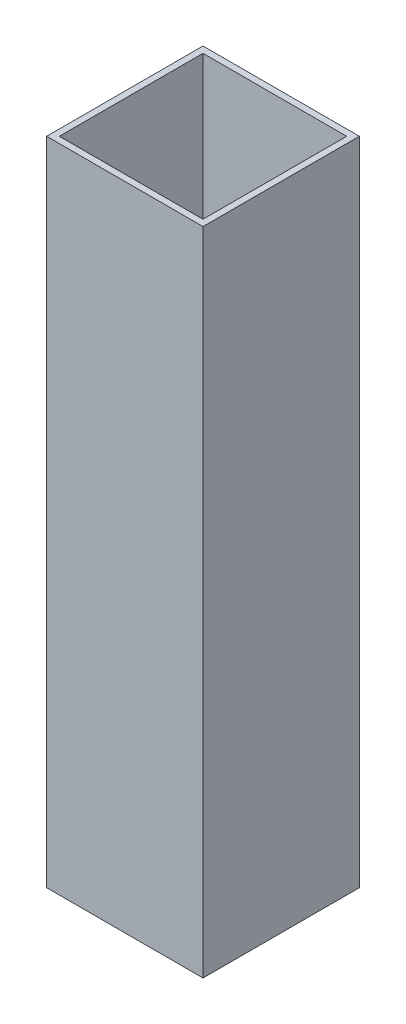
ISO-10303-21;
HEADER;
FILE_DESCRIPTION(('STEP AP214'),'2;1');
FILE_NAME('part.step','',(''),(''),'','','');
FILE_SCHEMA(('AUTOMOTIVE_DESIGN { 1 0 10303 214 1 1 1 1 }'));
ENDSEC;
DATA;
#1=APPLICATION_CONTEXT('core data for automotive mechanical design processes');
#2=APPLICATION_PROTOCOL_DEFINITION('international standard','automotive_design',2000,#1);
#3=PRODUCT_CONTEXT('',#1,'mechanical');
#4=PRODUCT('Part','Part','',(#3));
#5=PRODUCT_RELATED_PRODUCT_CATEGORY('part','',(#4));
#6=PRODUCT_DEFINITION_FORMATION('','',#4);
#7=PRODUCT_DEFINITION_CONTEXT('part definition',#1,'design');
#8=PRODUCT_DEFINITION('design','',#6,#7);
#9=PRODUCT_DEFINITION_SHAPE('','',#8);
#10=(LENGTH_UNIT() NAMED_UNIT(*) SI_UNIT(.MILLI.,.METRE.));
#11=(NAMED_UNIT(*) PLANE_ANGLE_UNIT() SI_UNIT($,.RADIAN.));
#12=(NAMED_UNIT(*) SI_UNIT($,.STERADIAN.) SOLID_ANGLE_UNIT());
#13=UNCERTAINTY_MEASURE_WITH_UNIT(LENGTH_MEASURE(1.E-05),#10,'distance_accuracy_value','');
#14=(GEOMETRIC_REPRESENTATION_CONTEXT(3) GLOBAL_UNCERTAINTY_ASSIGNED_CONTEXT((#13)) GLOBAL_UNIT_ASSIGNED_CONTEXT((#10,
#11,#12)) REPRESENTATION_CONTEXT('',''));
#15=CARTESIAN_POINT('',(0.,0.,0.));
#16=DIRECTION('',(0.,0.,1.));
#17=DIRECTION('',(1.,0.,0.));
#18=AXIS2_PLACEMENT_3D('',#15,#16,#17);
#19=CARTESIAN_POINT('',(-9.398,76.2,0.));
#20=DIRECTION('',(-1.,0.,0.));
#21=DIRECTION('',(0.,0.,1.));
#22=AXIS2_PLACEMENT_3D('',#19,#20,#21);
#23=PLANE('',#22);
#24=DIRECTION('',(0.,-1.,0.));
#25=VECTOR('',#24,1.);
#26=CARTESIAN_POINT('',(-9.398,76.2,-9.398));
#27=LINE('',#26,#25);
#28=CARTESIAN_POINT('',(-9.398,76.2,-9.398));
#29=VERTEX_POINT('',#28);
#30=CARTESIAN_POINT('',(-9.398,-2.032,-9.398));
#31=VERTEX_POINT('',#30);
#32=EDGE_CURVE('E59',#29,#31,#27,.T.);
#33=ORIENTED_EDGE('',*,*,#32,.T.);
#34=DIRECTION('',(0.,0.,-1.));
#35=VECTOR('',#34,1.);
#36=CARTESIAN_POINT('',(-9.398,-2.032,9.398));
#37=LINE('',#36,#35);
#38=CARTESIAN_POINT('',(-9.398,-2.032,9.398));
#39=VERTEX_POINT('',#38);
#40=EDGE_CURVE('E180',#39,#31,#37,.T.);
#41=ORIENTED_EDGE('',*,*,#40,.F.);
#42=DIRECTION('',(0.,-1.,0.));
#43=VECTOR('',#42,1.);
#44=CARTESIAN_POINT('',(-9.398,76.2,9.398));
#45=LINE('',#44,#43);
#46=CARTESIAN_POINT('',(-9.398,76.2,9.398));
#47=VERTEX_POINT('',#46);
#48=EDGE_CURVE('E11',#47,#39,#45,.T.);
#49=ORIENTED_EDGE('',*,*,#48,.F.);
#50=DIRECTION('',(0.,0.,-1.));
#51=VECTOR('',#50,1.);
#52=CARTESIAN_POINT('',(-9.398,76.2,0.));
#53=LINE('',#52,#51);
#54=EDGE_CURVE('E126',#47,#29,#53,.T.);
#55=ORIENTED_EDGE('',*,*,#54,.T.);
#56=EDGE_LOOP('',(#33,#41,#49,#55));
#57=FACE_BOUND('',#56,.T.);
#58=ADVANCED_FACE('F39',(#57),#23,.T.);
#59=CARTESIAN_POINT('',(0.,76.2,9.398));
#60=DIRECTION('',(0.,0.,-1.));
#61=DIRECTION('',(-1.,0.,0.));
#62=AXIS2_PLACEMENT_3D('',#59,#60,#61);
#63=PLANE('',#62);
#64=ORIENTED_EDGE('',*,*,#48,.T.);
#65=DIRECTION('',(-1.,0.,0.));
#66=VECTOR('',#65,1.);
#67=CARTESIAN_POINT('',(-9.398,-2.032,9.398));
#68=LINE('',#67,#66);
#69=CARTESIAN_POINT('',(9.398,-2.032,9.398));
#70=VERTEX_POINT('',#69);
#71=EDGE_CURVE('E132',#70,#39,#68,.T.);
#72=ORIENTED_EDGE('',*,*,#71,.F.);
#73=DIRECTION('',(0.,-1.,0.));
#74=VECTOR('',#73,1.);
#75=CARTESIAN_POINT('',(9.398,76.2,9.398));
#76=LINE('',#75,#74);
#77=CARTESIAN_POINT('',(9.398,76.2,9.398));
#78=VERTEX_POINT('',#77);
#79=EDGE_CURVE('E50',#78,#70,#76,.T.);
#80=ORIENTED_EDGE('',*,*,#79,.F.);
#81=DIRECTION('',(1.,0.,0.));
#82=VECTOR('',#81,1.);
#83=CARTESIAN_POINT('',(0.,76.2,9.398));
#84=LINE('',#83,#82);
#85=EDGE_CURVE('E121',#47,#78,#84,.T.);
#86=ORIENTED_EDGE('',*,*,#85,.F.);
#87=EDGE_LOOP('',(#64,#72,#80,#86));
#88=FACE_BOUND('',#87,.T.);
#89=ADVANCED_FACE('F130',(#88),#63,.F.);
#90=CARTESIAN_POINT('',(9.398,76.2,0.));
#91=DIRECTION('',(-1.,0.,0.));
#92=DIRECTION('',(0.,0.,1.));
#93=AXIS2_PLACEMENT_3D('',#90,#91,#92);
#94=PLANE('',#93);
#95=ORIENTED_EDGE('',*,*,#79,.T.);
#96=DIRECTION('',(0.,0.,1.));
#97=VECTOR('',#96,1.);
#98=CARTESIAN_POINT('',(9.398,-2.032,9.398));
#99=LINE('',#98,#97);
#100=CARTESIAN_POINT('',(9.398,-2.032,-9.398));
#101=VERTEX_POINT('',#100);
#102=EDGE_CURVE('E165',#101,#70,#99,.T.);
#103=ORIENTED_EDGE('',*,*,#102,.F.);
#104=DIRECTION('',(0.,-1.,0.));
#105=VECTOR('',#104,1.);
#106=CARTESIAN_POINT('',(9.398,76.2,-9.398));
#107=LINE('',#106,#105);
#108=CARTESIAN_POINT('',(9.398,76.2,-9.398));
#109=VERTEX_POINT('',#108);
#110=EDGE_CURVE('E117',#109,#101,#107,.T.);
#111=ORIENTED_EDGE('',*,*,#110,.F.);
#112=DIRECTION('',(0.,0.,-1.));
#113=VECTOR('',#112,1.);
#114=CARTESIAN_POINT('',(9.398,76.2,0.));
#115=LINE('',#114,#113);
#116=EDGE_CURVE('E109',#78,#109,#115,.T.);
#117=ORIENTED_EDGE('',*,*,#116,.F.);
#118=EDGE_LOOP('',(#95,#103,#111,#117));
#119=FACE_BOUND('',#118,.T.);
#120=ADVANCED_FACE('F111',(#119),#94,.F.);
#121=CARTESIAN_POINT('',(8.636,76.2,0.));
#122=DIRECTION('',(-1.,0.,0.));
#123=DIRECTION('',(0.,0.,1.));
#124=AXIS2_PLACEMENT_3D('',#121,#122,#123);
#125=PLANE('',#124);
#126=DIRECTION('',(0.,0.,-1.));
#127=VECTOR('',#126,1.);
#128=CARTESIAN_POINT('',(8.636,0.,0.));
#129=LINE('',#128,#127);
#130=CARTESIAN_POINT('',(8.636,0.,8.636));
#131=VERTEX_POINT('',#130);
#132=CARTESIAN_POINT('',(8.636,0.,-8.636));
#133=VERTEX_POINT('',#132);
#134=EDGE_CURVE('E162',#131,#133,#129,.T.);
#135=ORIENTED_EDGE('',*,*,#134,.F.);
#136=DIRECTION('',(0.,-1.,0.));
#137=VECTOR('',#136,1.);
#138=CARTESIAN_POINT('',(8.636,76.2,8.636));
#139=LINE('',#138,#137);
#140=CARTESIAN_POINT('',(8.636,76.2,8.636));
#141=VERTEX_POINT('',#140);
#142=EDGE_CURVE('E43',#141,#131,#139,.T.);
#143=ORIENTED_EDGE('',*,*,#142,.F.);
#144=DIRECTION('',(0.,0.,-1.));
#145=VECTOR('',#144,1.);
#146=CARTESIAN_POINT('',(8.636,76.2,0.));
#147=LINE('',#146,#145);
#148=CARTESIAN_POINT('',(8.636,76.2,-8.636));
#149=VERTEX_POINT('',#148);
#150=EDGE_CURVE('E157',#141,#149,#147,.T.);
#151=ORIENTED_EDGE('',*,*,#150,.T.);
#152=DIRECTION('',(0.,-1.,0.));
#153=VECTOR('',#152,1.);
#154=CARTESIAN_POINT('',(8.636,76.2,-8.636));
#155=LINE('',#154,#153);
#156=EDGE_CURVE('E85',#149,#133,#155,.T.);
#157=ORIENTED_EDGE('',*,*,#156,.T.);
#158=EDGE_LOOP('',(#135,#143,#151,#157));
#159=FACE_BOUND('',#158,.T.);
#160=ADVANCED_FACE('F41',(#159),#125,.T.);
#161=CARTESIAN_POINT('',(0.,76.2,8.636));
#162=DIRECTION('',(0.,0.,-1.));
#163=DIRECTION('',(-1.,0.,0.));
#164=AXIS2_PLACEMENT_3D('',#161,#162,#163);
#165=PLANE('',#164);
#166=DIRECTION('',(1.,0.,0.));
#167=VECTOR('',#166,1.);
#168=CARTESIAN_POINT('',(0.,0.,8.636));
#169=LINE('',#168,#167);
#170=CARTESIAN_POINT('',(-8.636,0.,8.636));
#171=VERTEX_POINT('',#170);
#172=EDGE_CURVE('E159',#171,#131,#169,.T.);
#173=ORIENTED_EDGE('',*,*,#172,.F.);
#174=DIRECTION('',(0.,-1.,0.));
#175=VECTOR('',#174,1.);
#176=CARTESIAN_POINT('',(-8.636,76.2,8.636));
#177=LINE('',#176,#175);
#178=CARTESIAN_POINT('',(-8.636,76.2,8.636));
#179=VERTEX_POINT('',#178);
#180=EDGE_CURVE('E140',#179,#171,#177,.T.);
#181=ORIENTED_EDGE('',*,*,#180,.F.);
#182=DIRECTION('',(1.,0.,0.));
#183=VECTOR('',#182,1.);
#184=CARTESIAN_POINT('',(0.,76.2,8.636));
#185=LINE('',#184,#183);
#186=EDGE_CURVE('E172',#179,#141,#185,.T.);
#187=ORIENTED_EDGE('',*,*,#186,.T.);
#188=ORIENTED_EDGE('',*,*,#142,.T.);
#189=EDGE_LOOP('',(#173,#181,#187,#188));
#190=FACE_BOUND('',#189,.T.);
#191=ADVANCED_FACE('F205',(#190),#165,.T.);
#192=CARTESIAN_POINT('',(-8.636,76.2,0.));
#193=DIRECTION('',(-1.,0.,0.));
#194=DIRECTION('',(0.,0.,1.));
#195=AXIS2_PLACEMENT_3D('',#192,#193,#194);
#196=PLANE('',#195);
#197=DIRECTION('',(0.,0.,-1.));
#198=VECTOR('',#197,1.);
#199=CARTESIAN_POINT('',(-8.636,0.,0.));
#200=LINE('',#199,#198);
#201=CARTESIAN_POINT('',(-8.636,0.,-8.636));
#202=VERTEX_POINT('',#201);
#203=EDGE_CURVE('E77',#171,#202,#200,.T.);
#204=ORIENTED_EDGE('',*,*,#203,.T.);
#205=DIRECTION('',(0.,-1.,0.));
#206=VECTOR('',#205,1.);
#207=CARTESIAN_POINT('',(-8.636,76.2,-8.636));
#208=LINE('',#207,#206);
#209=CARTESIAN_POINT('',(-8.636,76.2,-8.636));
#210=VERTEX_POINT('',#209);
#211=EDGE_CURVE('E138',#210,#202,#208,.T.);
#212=ORIENTED_EDGE('',*,*,#211,.F.);
#213=DIRECTION('',(0.,0.,-1.));
#214=VECTOR('',#213,1.);
#215=CARTESIAN_POINT('',(-8.636,76.2,0.));
#216=LINE('',#215,#214);
#217=EDGE_CURVE('E170',#179,#210,#216,.T.);
#218=ORIENTED_EDGE('',*,*,#217,.F.);
#219=ORIENTED_EDGE('',*,*,#180,.T.);
#220=EDGE_LOOP('',(#204,#212,#218,#219));
#221=FACE_BOUND('',#220,.T.);
#222=ADVANCED_FACE('F207',(#221),#196,.F.);
#223=CARTESIAN_POINT('',(0.,76.2,-8.636));
#224=DIRECTION('',(0.,0.,-1.));
#225=DIRECTION('',(-1.,0.,0.));
#226=AXIS2_PLACEMENT_3D('',#223,#224,#225);
#227=PLANE('',#226);
#228=DIRECTION('',(1.,0.,0.));
#229=VECTOR('',#228,1.);
#230=CARTESIAN_POINT('',(0.,0.,-8.636));
#231=LINE('',#230,#229);
#232=EDGE_CURVE('E154',#202,#133,#231,.T.);
#233=ORIENTED_EDGE('',*,*,#232,.T.);
#234=ORIENTED_EDGE('',*,*,#156,.F.);
#235=DIRECTION('',(1.,0.,0.));
#236=VECTOR('',#235,1.);
#237=CARTESIAN_POINT('',(0.,76.2,-8.636));
#238=LINE('',#237,#236);
#239=EDGE_CURVE('E168',#210,#149,#238,.T.);
#240=ORIENTED_EDGE('',*,*,#239,.F.);
#241=ORIENTED_EDGE('',*,*,#211,.T.);
#242=EDGE_LOOP('',(#233,#234,#240,#241));
#243=FACE_BOUND('',#242,.T.);
#244=ADVANCED_FACE('F211',(#243),#227,.F.);
#245=CARTESIAN_POINT('',(0.,76.2,-9.398));
#246=DIRECTION('',(0.,0.,-1.));
#247=DIRECTION('',(-1.,0.,0.));
#248=AXIS2_PLACEMENT_3D('',#245,#246,#247);
#249=PLANE('',#248);
#250=ORIENTED_EDGE('',*,*,#110,.T.);
#251=DIRECTION('',(1.,0.,0.));
#252=VECTOR('',#251,1.);
#253=CARTESIAN_POINT('',(-9.398,-2.032,-9.398));
#254=LINE('',#253,#252);
#255=EDGE_CURVE('E176',#31,#101,#254,.T.);
#256=ORIENTED_EDGE('',*,*,#255,.F.);
#257=ORIENTED_EDGE('',*,*,#32,.F.);
#258=DIRECTION('',(1.,0.,0.));
#259=VECTOR('',#258,1.);
#260=CARTESIAN_POINT('',(0.,76.2,-9.398));
#261=LINE('',#260,#259);
#262=EDGE_CURVE('E120',#29,#109,#261,.T.);
#263=ORIENTED_EDGE('',*,*,#262,.T.);
#264=EDGE_LOOP('',(#250,#256,#257,#263));
#265=FACE_BOUND('',#264,.T.);
#266=ADVANCED_FACE('F213',(#265),#249,.T.);
#267=CARTESIAN_POINT('',(0.,76.2,0.));
#268=DIRECTION('',(0.,1.,0.));
#269=DIRECTION('',(0.,0.,1.));
#270=AXIS2_PLACEMENT_3D('',#267,#268,#269);
#271=PLANE('',#270);
#272=ORIENTED_EDGE('',*,*,#150,.F.);
#273=ORIENTED_EDGE('',*,*,#186,.F.);
#274=ORIENTED_EDGE('',*,*,#217,.T.);
#275=ORIENTED_EDGE('',*,*,#239,.T.);
#276=EDGE_LOOP('',(#272,#273,#274,#275));
#277=FACE_BOUND('',#276,.T.);
#278=ORIENTED_EDGE('',*,*,#54,.F.);
#279=ORIENTED_EDGE('',*,*,#85,.T.);
#280=ORIENTED_EDGE('',*,*,#116,.T.);
#281=ORIENTED_EDGE('',*,*,#262,.F.);
#282=EDGE_LOOP('',(#278,#279,#280,#281));
#283=FACE_BOUND('',#282,.T.);
#284=ADVANCED_FACE('F125',(#277,#283),#271,.T.);
#285=CARTESIAN_POINT('',(0.,0.,0.));
#286=DIRECTION('',(0.,1.,0.));
#287=DIRECTION('',(0.,0.,1.));
#288=AXIS2_PLACEMENT_3D('',#285,#286,#287);
#289=PLANE('',#288);
#290=CARTESIAN_POINT('',(0.,0.,0.));
#291=DIRECTION('',(0.,1.,0.));
#292=DIRECTION('',(0.,0.,1.));
#293=AXIS2_PLACEMENT_3D('',#290,#291,#292);
#294=CIRCLE('',#293,2.28599999999999);
#295=CARTESIAN_POINT('',(0.,0.,2.28599999999999));
#296=VERTEX_POINT('',#295);
#297=EDGE_CURVE('E184',#296,#296,#294,.T.);
#298=ORIENTED_EDGE('',*,*,#297,.F.);
#299=EDGE_LOOP('',(#298));
#300=FACE_BOUND('',#299,.T.);
#301=ORIENTED_EDGE('',*,*,#172,.T.);
#302=ORIENTED_EDGE('',*,*,#134,.T.);
#303=ORIENTED_EDGE('',*,*,#232,.F.);
#304=ORIENTED_EDGE('',*,*,#203,.F.);
#305=EDGE_LOOP('',(#301,#302,#303,#304));
#306=FACE_BOUND('',#305,.T.);
#307=ADVANCED_FACE('F196',(#300,#306),#289,.T.);
#308=CARTESIAN_POINT('',(0.,-2.032,0.));
#309=DIRECTION('',(0.,1.,0.));
#310=DIRECTION('',(0.,0.,1.));
#311=AXIS2_PLACEMENT_3D('',#308,#309,#310);
#312=PLANE('',#311);
#313=CARTESIAN_POINT('',(0.,-2.032,0.));
#314=DIRECTION('',(0.,-1.,0.));
#315=DIRECTION('',(0.,0.,-1.));
#316=AXIS2_PLACEMENT_3D('',#313,#314,#315);
#317=CIRCLE('',#316,2.28599999999999);
#318=CARTESIAN_POINT('',(0.,-2.032,-2.28599999999999));
#319=VERTEX_POINT('',#318);
#320=EDGE_CURVE('E187',#319,#319,#317,.T.);
#321=ORIENTED_EDGE('',*,*,#320,.F.);
#322=EDGE_LOOP('',(#321));
#323=FACE_BOUND('',#322,.T.);
#324=ORIENTED_EDGE('',*,*,#71,.T.);
#325=ORIENTED_EDGE('',*,*,#40,.T.);
#326=ORIENTED_EDGE('',*,*,#255,.T.);
#327=ORIENTED_EDGE('',*,*,#102,.T.);
#328=EDGE_LOOP('',(#324,#325,#326,#327));
#329=FACE_BOUND('',#328,.T.);
#330=ADVANCED_FACE('F193',(#323,#329),#312,.F.);
#331=CARTESIAN_POINT('',(0.,-2.032,0.));
#332=DIRECTION('',(0.,-1.,0.));
#333=DIRECTION('',(0.,0.,-1.));
#334=AXIS2_PLACEMENT_3D('',#331,#332,#333);
#335=CYLINDRICAL_SURFACE('',#334,2.28599999999999);
#336=ORIENTED_EDGE('',*,*,#297,.T.);
#337=EDGE_LOOP('',(#336));
#338=FACE_BOUND('',#337,.T.);
#339=ORIENTED_EDGE('',*,*,#320,.T.);
#340=EDGE_LOOP('',(#339));
#341=FACE_BOUND('',#340,.T.);
#342=ADVANCED_FACE('F191',(#338,#341),#335,.F.);
#343=CLOSED_SHELL('',(#58,#89,#120,#160,#191,#222,#244,#266,#284,#307,#330,#342));
#344=MANIFOLD_SOLID_BREP('B2',#343);
#345=ADVANCED_BREP_SHAPE_REPRESENTATION('',(#18,#344),#14);
#346=SHAPE_DEFINITION_REPRESENTATION(#9,#345);
ENDSEC;
END-ISO-10303-21;
